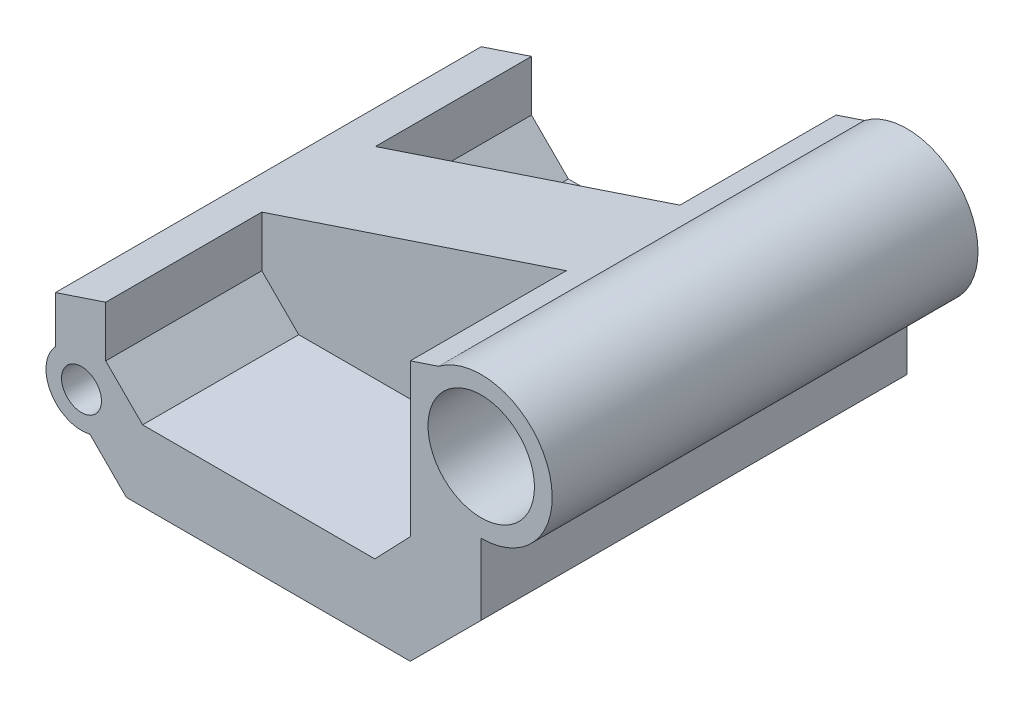
ISO-10303-21;
HEADER;
FILE_DESCRIPTION(('STEP AP214'),'2;1');
FILE_NAME('part.step','',(''),(''),'','','');
FILE_SCHEMA(('AUTOMOTIVE_DESIGN { 1 0 10303 214 1 1 1 1 }'));
ENDSEC;
DATA;
#1=APPLICATION_CONTEXT('core data for automotive mechanical design processes');
#2=APPLICATION_PROTOCOL_DEFINITION('international standard','automotive_design',2000,#1);
#3=PRODUCT_CONTEXT('',#1,'mechanical');
#4=PRODUCT('Part','Part','',(#3));
#5=PRODUCT_RELATED_PRODUCT_CATEGORY('part','',(#4));
#6=PRODUCT_DEFINITION_FORMATION('','',#4);
#7=PRODUCT_DEFINITION_CONTEXT('part definition',#1,'design');
#8=PRODUCT_DEFINITION('design','',#6,#7);
#9=PRODUCT_DEFINITION_SHAPE('','',#8);
#10=(LENGTH_UNIT() NAMED_UNIT(*) SI_UNIT(.MILLI.,.METRE.));
#11=(NAMED_UNIT(*) PLANE_ANGLE_UNIT() SI_UNIT($,.RADIAN.));
#12=(NAMED_UNIT(*) SI_UNIT($,.STERADIAN.) SOLID_ANGLE_UNIT());
#13=UNCERTAINTY_MEASURE_WITH_UNIT(LENGTH_MEASURE(1.E-05),#10,'distance_accuracy_value','');
#14=(GEOMETRIC_REPRESENTATION_CONTEXT(3) GLOBAL_UNCERTAINTY_ASSIGNED_CONTEXT((#13)) GLOBAL_UNIT_ASSIGNED_CONTEXT((#10,
#11,#12)) REPRESENTATION_CONTEXT('',''));
#15=CARTESIAN_POINT('',(0.,0.,0.));
#16=DIRECTION('',(0.,0.,1.));
#17=DIRECTION('',(1.,0.,0.));
#18=AXIS2_PLACEMENT_3D('',#15,#16,#17);
#19=CARTESIAN_POINT('',(25.4,1.40461226177703,-19.05));
#20=DIRECTION('',(1.,0.,0.));
#21=DIRECTION('',(0.,0.,-1.));
#22=AXIS2_PLACEMENT_3D('',#19,#20,#21);
#23=PLANE('',#22);
#24=DIRECTION('',(0.,0.,-1.));
#25=VECTOR('',#24,1.);
#26=CARTESIAN_POINT('',(25.4,10.0924921525294,12.7));
#27=LINE('',#26,#25);
#28=CARTESIAN_POINT('',(25.4,10.0924921525294,-1.27));
#29=VERTEX_POINT('',#28);
#30=CARTESIAN_POINT('',(25.4,10.0924921525294,-12.7));
#31=VERTEX_POINT('',#30);
#32=EDGE_CURVE('E239',#29,#31,#27,.T.);
#33=ORIENTED_EDGE('',*,*,#32,.F.);
#34=DIRECTION('',(0.,-1.,0.));
#35=VECTOR('',#34,1.);
#36=CARTESIAN_POINT('',(25.4,14.104612261777,-1.27));
#37=LINE('',#36,#35);
#38=CARTESIAN_POINT('',(25.4,14.104612261777,-1.27));
#39=VERTEX_POINT('',#38);
#40=EDGE_CURVE('E223',#39,#29,#37,.T.);
#41=ORIENTED_EDGE('',*,*,#40,.F.);
#42=DIRECTION('',(0.,0.,1.));
#43=VECTOR('',#42,1.);
#44=CARTESIAN_POINT('',(25.4,14.104612261777,-19.05));
#45=LINE('',#44,#43);
#46=CARTESIAN_POINT('',(25.4,14.104612261777,-19.05));
#47=VERTEX_POINT('',#46);
#48=EDGE_CURVE('E414',#47,#39,#45,.T.);
#49=ORIENTED_EDGE('',*,*,#48,.F.);
#50=DIRECTION('',(0.,1.,0.));
#51=VECTOR('',#50,1.);
#52=CARTESIAN_POINT('',(25.4,1.40461226177703,-19.05));
#53=LINE('',#52,#51);
#54=CARTESIAN_POINT('',(25.4,9.90939841905211,-19.05));
#55=VERTEX_POINT('',#54);
#56=EDGE_CURVE('E402',#55,#47,#53,.T.);
#57=ORIENTED_EDGE('',*,*,#56,.F.);
#58=DIRECTION('',(0.,0.,1.));
#59=VECTOR('',#58,1.);
#60=CARTESIAN_POINT('',(25.4,9.90939841905211,-25.6706541667691));
#61=LINE('',#60,#59);
#62=CARTESIAN_POINT('',(25.4,9.90939841905211,-12.7));
#63=VERTEX_POINT('',#62);
#64=EDGE_CURVE('E269',#55,#63,#61,.T.);
#65=ORIENTED_EDGE('',*,*,#64,.T.);
#66=DIRECTION('',(0.,-1.,0.));
#67=VECTOR('',#66,1.);
#68=CARTESIAN_POINT('',(25.4,1.40461226177703,-12.7));
#69=LINE('',#68,#67);
#70=EDGE_CURVE('E61',#31,#63,#69,.T.);
#71=ORIENTED_EDGE('',*,*,#70,.F.);
#72=EDGE_LOOP('',(#33,#41,#49,#57,#65,#71));
#73=FACE_BOUND('',#72,.T.);
#74=ADVANCED_FACE('F39',(#73),#23,.F.);
#75=CARTESIAN_POINT('',(27.7318493983136,7.75461226177703,-25.6706541667691));
#76=DIRECTION('',(0.,0.,1.));
#77=DIRECTION('',(1.,0.,0.));
#78=AXIS2_PLACEMENT_3D('',#75,#76,#77);
#79=CYLINDRICAL_SURFACE('',#78,3.175);
#80=DIRECTION('',(0.,0.,1.));
#81=VECTOR('',#80,1.);
#82=CARTESIAN_POINT('',(28.4845002373873,4.67011202438982,-25.6706541667691));
#83=LINE('',#82,#81);
#84=CARTESIAN_POINT('',(28.4845002373873,4.67011202438982,-19.05));
#85=VERTEX_POINT('',#84);
#86=CARTESIAN_POINT('',(28.4845002373873,4.67011202438982,-12.7));
#87=VERTEX_POINT('',#86);
#88=EDGE_CURVE('E265',#85,#87,#83,.T.);
#89=ORIENTED_EDGE('',*,*,#88,.T.);
#90=CARTESIAN_POINT('',(27.7318493983136,7.75461226177703,-12.7));
#91=DIRECTION('',(0.,0.,1.));
#92=DIRECTION('',(1.,0.,0.));
#93=AXIS2_PLACEMENT_3D('',#90,#91,#92);
#94=CIRCLE('',#93,3.175);
#95=EDGE_CURVE('E423',#87,#63,#94,.F.);
#96=ORIENTED_EDGE('',*,*,#95,.T.);
#97=ORIENTED_EDGE('',*,*,#64,.F.);
#98=CARTESIAN_POINT('',(27.7318493983136,7.75461226177703,-19.05));
#99=DIRECTION('',(0.,0.,-1.));
#100=DIRECTION('',(-1.,0.,0.));
#101=AXIS2_PLACEMENT_3D('',#98,#99,#100);
#102=CIRCLE('',#101,3.175);
#103=EDGE_CURVE('E261',#55,#85,#102,.F.);
#104=ORIENTED_EDGE('',*,*,#103,.T.);
#105=EDGE_LOOP('',(#89,#96,#97,#104));
#106=FACE_BOUND('',#105,.T.);
#107=ADVANCED_FACE('F504',(#106),#79,.T.);
#108=CARTESIAN_POINT('',(27.7318493983136,7.75461226177703,19.05));
#109=DIRECTION('',(0.,0.,1.));
#110=DIRECTION('',(1.,0.,0.));
#111=AXIS2_PLACEMENT_3D('',#108,#109,#110);
#112=CYLINDRICAL_SURFACE('',#111,1.78600099999999);
#113=CARTESIAN_POINT('',(27.7318493983136,7.75461226177703,-19.05));
#114=DIRECTION('',(0.,0.,1.));
#115=DIRECTION('',(1.,0.,0.));
#116=AXIS2_PLACEMENT_3D('',#113,#114,#115);
#117=CIRCLE('',#116,1.78600099999999);
#118=CARTESIAN_POINT('',(29.5178503983136,7.75461226177703,-19.05));
#119=VERTEX_POINT('',#118);
#120=EDGE_CURVE('E255',#119,#119,#117,.T.);
#121=ORIENTED_EDGE('',*,*,#120,.F.);
#122=EDGE_LOOP('',(#121));
#123=FACE_BOUND('',#122,.T.);
#124=CARTESIAN_POINT('',(27.7318493983136,7.75461226177703,-12.7));
#125=DIRECTION('',(0.,0.,1.));
#126=DIRECTION('',(1.,0.,0.));
#127=AXIS2_PLACEMENT_3D('',#124,#125,#126);
#128=CIRCLE('',#127,1.78600099999999);
#129=CARTESIAN_POINT('',(29.5178503983136,7.75461226177703,-12.7));
#130=VERTEX_POINT('',#129);
#131=EDGE_CURVE('E420',#130,#130,#128,.F.);
#132=ORIENTED_EDGE('',*,*,#131,.F.);
#133=EDGE_LOOP('',(#132));
#134=FACE_BOUND('',#133,.T.);
#135=ADVANCED_FACE('F508',(#123,#134),#112,.F.);
#136=CARTESIAN_POINT('',(0.,0.,-19.05));
#137=DIRECTION('',(0.,0.,-1.));
#138=DIRECTION('',(-1.,0.,0.));
#139=AXIS2_PLACEMENT_3D('',#136,#137,#138);
#140=PLANE('',#139);
#141=ORIENTED_EDGE('',*,*,#120,.T.);
#142=EDGE_LOOP('',(#141));
#143=FACE_BOUND('',#142,.T.);
#144=ORIENTED_EDGE('',*,*,#103,.F.);
#145=ORIENTED_EDGE('',*,*,#56,.T.);
#146=DIRECTION('',(0.948683298050514,0.316227766016838,0.));
#147=VECTOR('',#146,1.);
#148=CARTESIAN_POINT('',(25.4,14.104612261777,-19.05));
#149=LINE('',#148,#147);
#150=CARTESIAN_POINT('',(29.899727950621,15.6045215786507,-19.05));
#151=VERTEX_POINT('',#150);
#152=EDGE_CURVE('E405',#47,#151,#149,.T.);
#153=ORIENTED_EDGE('',*,*,#152,.T.);
#154=DIRECTION('',(0.,1.,0.));
#155=VECTOR('',#154,1.);
#156=CARTESIAN_POINT('',(29.899727950621,7.75461226177703,-19.05));
#157=LINE('',#156,#155);
#158=CARTESIAN_POINT('',(29.899727950621,11.056612261777,-19.05));
#159=VERTEX_POINT('',#158);
#160=EDGE_CURVE('E300',#159,#151,#157,.T.);
#161=ORIENTED_EDGE('',*,*,#160,.F.);
#162=DIRECTION('',(-0.707106781186548,0.707106781186548,0.));
#163=VECTOR('',#162,1.);
#164=CARTESIAN_POINT('',(33.201727950621,7.75461226177703,-19.05));
#165=LINE('',#164,#163);
#166=CARTESIAN_POINT('',(33.201727950621,7.75461226177703,-19.05));
#167=VERTEX_POINT('',#166);
#168=EDGE_CURVE('E274',#167,#159,#165,.T.);
#169=ORIENTED_EDGE('',*,*,#168,.F.);
#170=DIRECTION('',(-1.,0.,0.));
#171=VECTOR('',#170,1.);
#172=CARTESIAN_POINT('',(53.975,7.75461226177703,-19.05));
#173=LINE('',#172,#171);
#174=CARTESIAN_POINT('',(53.975,7.75461226177703,-19.05));
#175=VERTEX_POINT('',#174);
#176=EDGE_CURVE('E316',#175,#167,#173,.T.);
#177=ORIENTED_EDGE('',*,*,#176,.F.);
#178=DIRECTION('',(-0.693108716251784,-0.720833064901856,0.));
#179=VECTOR('',#178,1.);
#180=CARTESIAN_POINT('',(57.15,11.056612261777,-19.05));
#181=LINE('',#180,#179);
#182=CARTESIAN_POINT('',(57.15,11.056612261777,-19.05));
#183=VERTEX_POINT('',#182);
#184=EDGE_CURVE('E313',#183,#175,#181,.T.);
#185=ORIENTED_EDGE('',*,*,#184,.F.);
#186=DIRECTION('',(0.,-1.,0.));
#187=VECTOR('',#186,1.);
#188=CARTESIAN_POINT('',(57.15,24.6879455951104,-19.05));
#189=LINE('',#188,#187);
#190=CARTESIAN_POINT('',(57.15,24.6879455951104,-19.05));
#191=VERTEX_POINT('',#190);
#192=EDGE_CURVE('E295',#191,#183,#189,.T.);
#193=ORIENTED_EDGE('',*,*,#192,.F.);
#194=CARTESIAN_POINT('',(59.69,25.534612261777,-19.05));
#195=VERTEX_POINT('',#194);
#196=EDGE_CURVE('E404',#191,#195,#149,.T.);
#197=ORIENTED_EDGE('',*,*,#196,.T.);
#198=CARTESIAN_POINT('',(63.5,20.454612261777,-19.05));
#199=DIRECTION('',(0.,0.,-1.));
#200=DIRECTION('',(-1.,0.,0.));
#201=AXIS2_PLACEMENT_3D('',#198,#199,#200);
#202=CIRCLE('',#201,6.35);
#203=CARTESIAN_POINT('',(63.5,14.104612261777,-19.05));
#204=VERTEX_POINT('',#203);
#205=EDGE_CURVE('E381',#204,#195,#202,.F.);
#206=ORIENTED_EDGE('',*,*,#205,.F.);
#207=DIRECTION('',(0.,-1.,0.));
#208=VECTOR('',#207,1.);
#209=CARTESIAN_POINT('',(63.5,26.804612261777,-19.05));
#210=LINE('',#209,#208);
#211=CARTESIAN_POINT('',(63.5,7.75461226177704,-19.05));
#212=VERTEX_POINT('',#211);
#213=EDGE_CURVE('E408',#204,#212,#210,.T.);
#214=ORIENTED_EDGE('',*,*,#213,.T.);
#215=DIRECTION('',(-0.707106781186547,-0.707106781186548,0.));
#216=VECTOR('',#215,1.);
#217=CARTESIAN_POINT('',(63.5,7.75461226177704,-19.05));
#218=LINE('',#217,#216);
#219=CARTESIAN_POINT('',(57.15,1.40461226177703,-19.05));
#220=VERTEX_POINT('',#219);
#221=EDGE_CURVE('E364',#212,#220,#218,.T.);
#222=ORIENTED_EDGE('',*,*,#221,.T.);
#223=DIRECTION('',(1.,0.,0.));
#224=VECTOR('',#223,1.);
#225=CARTESIAN_POINT('',(25.4,1.40461226177703,-19.05));
#226=LINE('',#225,#224);
#227=CARTESIAN_POINT('',(31.7500000000001,1.40461226177703,-19.05));
#228=VERTEX_POINT('',#227);
#229=EDGE_CURVE('E411',#228,#220,#226,.T.);
#230=ORIENTED_EDGE('',*,*,#229,.F.);
#231=DIRECTION('',(0.707106781186556,-0.707106781186539,0.));
#232=VECTOR('',#231,1.);
#233=CARTESIAN_POINT('',(25.4,7.75461226177703,-19.05));
#234=LINE('',#233,#232);
#235=EDGE_CURVE('E289',#85,#228,#234,.T.);
#236=ORIENTED_EDGE('',*,*,#235,.F.);
#237=EDGE_LOOP('',(#144,#145,#153,#161,#169,#177,#185,#193,#197,#206,#214,#222,#230,#236));
#238=FACE_BOUND('',#237,.T.);
#239=CARTESIAN_POINT('',(63.5,20.454612261777,-19.05));
#240=DIRECTION('',(0.,0.,1.));
#241=DIRECTION('',(1.,0.,0.));
#242=AXIS2_PLACEMENT_3D('',#239,#240,#241);
#243=CIRCLE('',#242,4.76249999999999);
#244=CARTESIAN_POINT('',(68.2625,20.454612261777,-19.05));
#245=VERTEX_POINT('',#244);
#246=EDGE_CURVE('E375',#245,#245,#243,.T.);
#247=ORIENTED_EDGE('',*,*,#246,.T.);
#248=EDGE_LOOP('',(#247));
#249=FACE_BOUND('',#248,.T.);
#250=ADVANCED_FACE('F513',(#143,#238,#249),#140,.T.);
#251=CARTESIAN_POINT('',(25.4,14.104612261777,1.27));
#252=VERTEX_POINT('',#251);
#253=CARTESIAN_POINT('',(25.4,14.104612261777,19.05));
#254=VERTEX_POINT('',#253);
#255=EDGE_CURVE('E413',#252,#254,#45,.T.);
#256=ORIENTED_EDGE('',*,*,#255,.F.);
#257=DIRECTION('',(0.,1.,0.));
#258=VECTOR('',#257,1.);
#259=CARTESIAN_POINT('',(25.4,14.104612261777,1.27));
#260=LINE('',#259,#258);
#261=CARTESIAN_POINT('',(25.4,10.0924921525294,1.27));
#262=VERTEX_POINT('',#261);
#263=EDGE_CURVE('E234',#262,#252,#260,.T.);
#264=ORIENTED_EDGE('',*,*,#263,.F.);
#265=CARTESIAN_POINT('',(25.4,10.0924921525294,12.7));
#266=VERTEX_POINT('',#265);
#267=EDGE_CURVE('E243',#266,#262,#27,.T.);
#268=ORIENTED_EDGE('',*,*,#267,.F.);
#269=DIRECTION('',(0.,-1.,0.));
#270=VECTOR('',#269,1.);
#271=CARTESIAN_POINT('',(25.4,1.40461226177703,12.7));
#272=LINE('',#271,#270);
#273=CARTESIAN_POINT('',(25.4,9.90939841905211,12.7));
#274=VERTEX_POINT('',#273);
#275=EDGE_CURVE('E244',#266,#274,#272,.T.);
#276=ORIENTED_EDGE('',*,*,#275,.T.);
#277=CARTESIAN_POINT('',(25.4,9.90939841905211,19.05));
#278=VERTEX_POINT('',#277);
#279=EDGE_CURVE('E268',#274,#278,#61,.T.);
#280=ORIENTED_EDGE('',*,*,#279,.T.);
#281=DIRECTION('',(0.,1.,0.));
#282=VECTOR('',#281,1.);
#283=CARTESIAN_POINT('',(25.4,1.40461226177703,19.05));
#284=LINE('',#283,#282);
#285=EDGE_CURVE('E390',#278,#254,#284,.T.);
#286=ORIENTED_EDGE('',*,*,#285,.T.);
#287=EDGE_LOOP('',(#256,#264,#268,#276,#280,#286));
#288=FACE_BOUND('',#287,.T.);
#289=ADVANCED_FACE('F41',(#288),#23,.F.);
#290=CARTESIAN_POINT('',(25.4,1.40461226177703,-19.05));
#291=DIRECTION('',(0.,-1.,0.));
#292=DIRECTION('',(0.,0.,-1.));
#293=AXIS2_PLACEMENT_3D('',#290,#291,#292);
#294=PLANE('',#293);
#295=DIRECTION('',(1.,0.,0.));
#296=VECTOR('',#295,1.);
#297=CARTESIAN_POINT('',(25.4,1.40461226177703,19.05));
#298=LINE('',#297,#296);
#299=CARTESIAN_POINT('',(31.7500000000001,1.40461226177703,19.05));
#300=VERTEX_POINT('',#299);
#301=CARTESIAN_POINT('',(57.15,1.40461226177703,19.05));
#302=VERTEX_POINT('',#301);
#303=EDGE_CURVE('E400',#300,#302,#298,.T.);
#304=ORIENTED_EDGE('',*,*,#303,.F.);
#305=DIRECTION('',(0.,0.,1.));
#306=VECTOR('',#305,1.);
#307=CARTESIAN_POINT('',(31.7500000000001,1.40461226177703,-19.05));
#308=LINE('',#307,#306);
#309=EDGE_CURVE('E291',#228,#300,#308,.T.);
#310=ORIENTED_EDGE('',*,*,#309,.F.);
#311=ORIENTED_EDGE('',*,*,#229,.T.);
#312=DIRECTION('',(0.,0.,1.));
#313=VECTOR('',#312,1.);
#314=CARTESIAN_POINT('',(57.15,1.40461226177703,-28.0302561210692));
#315=LINE('',#314,#313);
#316=EDGE_CURVE('E367',#220,#302,#315,.T.);
#317=ORIENTED_EDGE('',*,*,#316,.T.);
#318=EDGE_LOOP('',(#304,#310,#311,#317));
#319=FACE_BOUND('',#318,.T.);
#320=ADVANCED_FACE('F512',(#319),#294,.T.);
#321=CARTESIAN_POINT('',(0.,0.,19.05));
#322=DIRECTION('',(0.,0.,-1.));
#323=DIRECTION('',(-1.,0.,0.));
#324=AXIS2_PLACEMENT_3D('',#321,#322,#323);
#325=PLANE('',#324);
#326=CARTESIAN_POINT('',(27.7318493983136,7.75461226177703,19.05));
#327=DIRECTION('',(0.,0.,1.));
#328=DIRECTION('',(1.,0.,0.));
#329=AXIS2_PLACEMENT_3D('',#326,#327,#328);
#330=CIRCLE('',#329,1.78600099999999);
#331=CARTESIAN_POINT('',(29.5178503983136,7.75461226177703,19.05));
#332=VERTEX_POINT('',#331);
#333=EDGE_CURVE('E247',#332,#332,#330,.T.);
#334=ORIENTED_EDGE('',*,*,#333,.F.);
#335=EDGE_LOOP('',(#334));
#336=FACE_BOUND('',#335,.T.);
#337=ORIENTED_EDGE('',*,*,#285,.F.);
#338=CARTESIAN_POINT('',(27.7318493983136,7.75461226177703,19.05));
#339=DIRECTION('',(0.,0.,1.));
#340=DIRECTION('',(1.,0.,0.));
#341=AXIS2_PLACEMENT_3D('',#338,#339,#340);
#342=CIRCLE('',#341,3.175);
#343=CARTESIAN_POINT('',(28.4845002373873,4.67011202438982,19.05));
#344=VERTEX_POINT('',#343);
#345=EDGE_CURVE('E258',#278,#344,#342,.T.);
#346=ORIENTED_EDGE('',*,*,#345,.T.);
#347=DIRECTION('',(0.707106781186556,-0.707106781186539,0.));
#348=VECTOR('',#347,1.);
#349=CARTESIAN_POINT('',(25.4,7.75461226177703,19.05));
#350=LINE('',#349,#348);
#351=EDGE_CURVE('E288',#344,#300,#350,.T.);
#352=ORIENTED_EDGE('',*,*,#351,.T.);
#353=ORIENTED_EDGE('',*,*,#303,.T.);
#354=DIRECTION('',(-0.707106781186547,-0.707106781186548,0.));
#355=VECTOR('',#354,1.);
#356=CARTESIAN_POINT('',(63.5,7.75461226177704,19.05));
#357=LINE('',#356,#355);
#358=CARTESIAN_POINT('',(63.5,7.75461226177704,19.05));
#359=VERTEX_POINT('',#358);
#360=EDGE_CURVE('E354',#359,#302,#357,.T.);
#361=ORIENTED_EDGE('',*,*,#360,.F.);
#362=DIRECTION('',(0.,-1.,0.));
#363=VECTOR('',#362,1.);
#364=CARTESIAN_POINT('',(63.5,26.804612261777,19.05));
#365=LINE('',#364,#363);
#366=CARTESIAN_POINT('',(63.5,14.104612261777,19.05));
#367=VERTEX_POINT('',#366);
#368=EDGE_CURVE('E397',#367,#359,#365,.T.);
#369=ORIENTED_EDGE('',*,*,#368,.F.);
#370=CARTESIAN_POINT('',(63.5,20.454612261777,19.05));
#371=DIRECTION('',(0.,0.,1.));
#372=DIRECTION('',(1.,0.,0.));
#373=AXIS2_PLACEMENT_3D('',#370,#371,#372);
#374=CIRCLE('',#373,6.35);
#375=CARTESIAN_POINT('',(59.69,25.534612261777,19.05));
#376=VERTEX_POINT('',#375);
#377=EDGE_CURVE('E378',#367,#376,#374,.T.);
#378=ORIENTED_EDGE('',*,*,#377,.T.);
#379=DIRECTION('',(0.948683298050514,0.316227766016838,0.));
#380=VECTOR('',#379,1.);
#381=CARTESIAN_POINT('',(25.4,14.104612261777,19.05));
#382=LINE('',#381,#380);
#383=CARTESIAN_POINT('',(57.15,24.6879455951104,19.05));
#384=VERTEX_POINT('',#383);
#385=EDGE_CURVE('E393',#384,#376,#382,.T.);
#386=ORIENTED_EDGE('',*,*,#385,.F.);
#387=DIRECTION('',(0.,1.,0.));
#388=VECTOR('',#387,1.);
#389=CARTESIAN_POINT('',(57.15,11.056612261777,19.05));
#390=LINE('',#389,#388);
#391=CARTESIAN_POINT('',(57.15,11.056612261777,19.05));
#392=VERTEX_POINT('',#391);
#393=EDGE_CURVE('E322',#392,#384,#390,.T.);
#394=ORIENTED_EDGE('',*,*,#393,.F.);
#395=DIRECTION('',(0.693108716251784,0.720833064901856,0.));
#396=VECTOR('',#395,1.);
#397=CARTESIAN_POINT('',(53.975,7.75461226177703,19.05));
#398=LINE('',#397,#396);
#399=CARTESIAN_POINT('',(53.975,7.75461226177703,19.05));
#400=VERTEX_POINT('',#399);
#401=EDGE_CURVE('E332',#400,#392,#398,.T.);
#402=ORIENTED_EDGE('',*,*,#401,.F.);
#403=DIRECTION('',(1.,0.,0.));
#404=VECTOR('',#403,1.);
#405=CARTESIAN_POINT('',(29.899727950621,7.75461226177703,19.05));
#406=LINE('',#405,#404);
#407=CARTESIAN_POINT('',(33.201727950621,7.75461226177703,19.05));
#408=VERTEX_POINT('',#407);
#409=EDGE_CURVE('E348',#408,#400,#406,.T.);
#410=ORIENTED_EDGE('',*,*,#409,.F.);
#411=DIRECTION('',(-0.707106781186547,0.707106781186547,0.));
#412=VECTOR('',#411,1.);
#413=CARTESIAN_POINT('',(33.201727950621,7.75461226177703,19.05));
#414=LINE('',#413,#412);
#415=CARTESIAN_POINT('',(29.899727950621,11.056612261777,19.05));
#416=VERTEX_POINT('',#415);
#417=EDGE_CURVE('E271',#408,#416,#414,.T.);
#418=ORIENTED_EDGE('',*,*,#417,.T.);
#419=DIRECTION('',(0.,-1.,0.));
#420=VECTOR('',#419,1.);
#421=CARTESIAN_POINT('',(29.899727950621,15.6045215786507,19.05));
#422=LINE('',#421,#420);
#423=CARTESIAN_POINT('',(29.899727950621,15.6045215786507,19.05));
#424=VERTEX_POINT('',#423);
#425=EDGE_CURVE('E345',#424,#416,#422,.T.);
#426=ORIENTED_EDGE('',*,*,#425,.F.);
#427=EDGE_CURVE('E394',#254,#424,#382,.T.);
#428=ORIENTED_EDGE('',*,*,#427,.F.);
#429=EDGE_LOOP('',(#337,#346,#352,#353,#361,#369,#378,#386,#394,#402,#410,#418,#426,#428));
#430=FACE_BOUND('',#429,.T.);
#431=CARTESIAN_POINT('',(63.5,20.454612261777,19.05));
#432=DIRECTION('',(0.,0.,1.));
#433=DIRECTION('',(1.,0.,0.));
#434=AXIS2_PLACEMENT_3D('',#431,#432,#433);
#435=CIRCLE('',#434,4.7625);
#436=CARTESIAN_POINT('',(68.2625,20.454612261777,19.05));
#437=VERTEX_POINT('',#436);
#438=EDGE_CURVE('E372',#437,#437,#435,.T.);
#439=ORIENTED_EDGE('',*,*,#438,.F.);
#440=EDGE_LOOP('',(#439));
#441=FACE_BOUND('',#440,.T.);
#442=ADVANCED_FACE('F473',(#336,#430,#441),#325,.F.);
#443=CARTESIAN_POINT('',(25.4,14.104612261777,-19.05));
#444=DIRECTION('',(0.316227766016838,-0.948683298050514,0.));
#445=DIRECTION('',(0.948683298050514,0.316227766016838,0.));
#446=AXIS2_PLACEMENT_3D('',#443,#444,#445);
#447=PLANE('',#446);
#448=DIRECTION('',(0.948683298050514,0.316227766016838,0.));
#449=VECTOR('',#448,1.);
#450=CARTESIAN_POINT('',(29.899727950621,15.6045215786507,-5.08));
#451=LINE('',#450,#449);
#452=CARTESIAN_POINT('',(29.899727950621,15.6045215786507,-5.08));
#453=VERTEX_POINT('',#452);
#454=CARTESIAN_POINT('',(57.15,24.6879455951104,-5.08));
#455=VERTEX_POINT('',#454);
#456=EDGE_CURVE('E296',#453,#455,#451,.T.);
#457=ORIENTED_EDGE('',*,*,#456,.F.);
#458=DIRECTION('',(0.,0.,-1.));
#459=VECTOR('',#458,1.);
#460=CARTESIAN_POINT('',(29.899727950621,15.6045215786507,-5.08));
#461=LINE('',#460,#459);
#462=EDGE_CURVE('E319',#453,#151,#461,.T.);
#463=ORIENTED_EDGE('',*,*,#462,.T.);
#464=ORIENTED_EDGE('',*,*,#152,.F.);
#465=ORIENTED_EDGE('',*,*,#48,.T.);
#466=DIRECTION('',(0.,0.,-1.));
#467=VECTOR('',#466,1.);
#468=CARTESIAN_POINT('',(25.4,14.104612261777,-1.27));
#469=LINE('',#468,#467);
#470=EDGE_CURVE('E443',#252,#39,#469,.T.);
#471=ORIENTED_EDGE('',*,*,#470,.F.);
#472=ORIENTED_EDGE('',*,*,#255,.T.);
#473=ORIENTED_EDGE('',*,*,#427,.T.);
#474=DIRECTION('',(0.,0.,1.));
#475=VECTOR('',#474,1.);
#476=CARTESIAN_POINT('',(29.899727950621,15.6045215786507,5.08));
#477=LINE('',#476,#475);
#478=CARTESIAN_POINT('',(29.899727950621,15.6045215786507,5.08));
#479=VERTEX_POINT('',#478);
#480=EDGE_CURVE('E358',#479,#424,#477,.T.);
#481=ORIENTED_EDGE('',*,*,#480,.F.);
#482=DIRECTION('',(-0.948683298050514,-0.316227766016838,0.));
#483=VECTOR('',#482,1.);
#484=CARTESIAN_POINT('',(57.15,24.6879455951104,5.08));
#485=LINE('',#484,#483);
#486=CARTESIAN_POINT('',(57.15,24.6879455951104,5.08));
#487=VERTEX_POINT('',#486);
#488=EDGE_CURVE('E331',#487,#479,#485,.T.);
#489=ORIENTED_EDGE('',*,*,#488,.F.);
#490=DIRECTION('',(0.,0.,1.));
#491=VECTOR('',#490,1.);
#492=CARTESIAN_POINT('',(57.15,24.6879455951104,5.08));
#493=LINE('',#492,#491);
#494=EDGE_CURVE('E343',#487,#384,#493,.T.);
#495=ORIENTED_EDGE('',*,*,#494,.T.);
#496=ORIENTED_EDGE('',*,*,#385,.T.);
#497=DIRECTION('',(0.,0.,1.));
#498=VECTOR('',#497,1.);
#499=CARTESIAN_POINT('',(59.69,25.534612261777,-37.0105122421383));
#500=LINE('',#499,#498);
#501=EDGE_CURVE('E387',#376,#195,#500,.F.);
#502=ORIENTED_EDGE('',*,*,#501,.T.);
#503=ORIENTED_EDGE('',*,*,#196,.F.);
#504=DIRECTION('',(0.,0.,-1.));
#505=VECTOR('',#504,1.);
#506=CARTESIAN_POINT('',(57.15,24.6879455951104,-5.08));
#507=LINE('',#506,#505);
#508=EDGE_CURVE('E310',#455,#191,#507,.T.);
#509=ORIENTED_EDGE('',*,*,#508,.F.);
#510=EDGE_LOOP('',(#457,#463,#464,#465,#471,#472,#473,#481,#489,#495,#496,#502,#503,#509));
#511=FACE_BOUND('',#510,.T.);
#512=ADVANCED_FACE('F480',(#511),#447,.F.);
#513=CARTESIAN_POINT('',(63.5,26.804612261777,-19.05));
#514=DIRECTION('',(-1.,0.,0.));
#515=DIRECTION('',(0.,0.,1.));
#516=AXIS2_PLACEMENT_3D('',#513,#514,#515);
#517=PLANE('',#516);
#518=ORIENTED_EDGE('',*,*,#368,.T.);
#519=DIRECTION('',(0.,0.,1.));
#520=VECTOR('',#519,1.);
#521=CARTESIAN_POINT('',(63.5,7.75461226177704,-28.0302561210692));
#522=LINE('',#521,#520);
#523=EDGE_CURVE('E370',#212,#359,#522,.T.);
#524=ORIENTED_EDGE('',*,*,#523,.F.);
#525=ORIENTED_EDGE('',*,*,#213,.F.);
#526=DIRECTION('',(0.,0.,1.));
#527=VECTOR('',#526,1.);
#528=CARTESIAN_POINT('',(63.5,14.104612261777,-37.0105122421383));
#529=LINE('',#528,#527);
#530=EDGE_CURVE('E384',#204,#367,#529,.T.);
#531=ORIENTED_EDGE('',*,*,#530,.T.);
#532=EDGE_LOOP('',(#518,#524,#525,#531));
#533=FACE_BOUND('',#532,.T.);
#534=ADVANCED_FACE('F532',(#533),#517,.F.);
#535=CARTESIAN_POINT('',(63.5,20.454612261777,-37.0105122421383));
#536=DIRECTION('',(0.,0.,1.));
#537=DIRECTION('',(1.,0.,0.));
#538=AXIS2_PLACEMENT_3D('',#535,#536,#537);
#539=CYLINDRICAL_SURFACE('',#538,6.35);
#540=ORIENTED_EDGE('',*,*,#501,.F.);
#541=ORIENTED_EDGE('',*,*,#377,.F.);
#542=ORIENTED_EDGE('',*,*,#530,.F.);
#543=ORIENTED_EDGE('',*,*,#205,.T.);
#544=EDGE_LOOP('',(#540,#541,#542,#543));
#545=FACE_BOUND('',#544,.T.);
#546=ADVANCED_FACE('F534',(#545),#539,.T.);
#547=CARTESIAN_POINT('',(63.5,20.454612261777,19.05));
#548=DIRECTION('',(0.,0.,1.));
#549=DIRECTION('',(1.,0.,0.));
#550=AXIS2_PLACEMENT_3D('',#547,#548,#549);
#551=CYLINDRICAL_SURFACE('',#550,4.7625);
#552=ORIENTED_EDGE('',*,*,#246,.F.);
#553=EDGE_LOOP('',(#552));
#554=FACE_BOUND('',#553,.T.);
#555=ORIENTED_EDGE('',*,*,#438,.T.);
#556=EDGE_LOOP('',(#555));
#557=FACE_BOUND('',#556,.T.);
#558=ADVANCED_FACE('F604',(#554,#557),#551,.F.);
#559=CARTESIAN_POINT('',(63.5,7.75461226177704,-28.0302561210692));
#560=DIRECTION('',(-0.707106781186548,0.707106781186547,0.));
#561=DIRECTION('',(-0.707106781186547,-0.707106781186548,0.));
#562=AXIS2_PLACEMENT_3D('',#559,#560,#561);
#563=PLANE('',#562);
#564=ORIENTED_EDGE('',*,*,#523,.T.);
#565=ORIENTED_EDGE('',*,*,#360,.T.);
#566=ORIENTED_EDGE('',*,*,#316,.F.);
#567=ORIENTED_EDGE('',*,*,#221,.F.);
#568=EDGE_LOOP('',(#564,#565,#566,#567));
#569=FACE_BOUND('',#568,.T.);
#570=ADVANCED_FACE('F600',(#569),#563,.F.);
#571=CARTESIAN_POINT('',(57.15,11.056612261777,5.08));
#572=DIRECTION('',(1.,0.,0.));
#573=DIRECTION('',(0.,1.,0.));
#574=AXIS2_PLACEMENT_3D('',#571,#572,#573);
#575=PLANE('',#574);
#576=ORIENTED_EDGE('',*,*,#393,.T.);
#577=ORIENTED_EDGE('',*,*,#494,.F.);
#578=DIRECTION('',(0.,1.,0.));
#579=VECTOR('',#578,1.);
#580=CARTESIAN_POINT('',(57.15,11.056612261777,5.08));
#581=LINE('',#580,#579);
#582=CARTESIAN_POINT('',(57.15,11.056612261777,5.08));
#583=VERTEX_POINT('',#582);
#584=EDGE_CURVE('E328',#583,#487,#581,.T.);
#585=ORIENTED_EDGE('',*,*,#584,.F.);
#586=DIRECTION('',(0.,0.,1.));
#587=VECTOR('',#586,1.);
#588=CARTESIAN_POINT('',(57.15,11.056612261777,5.08));
#589=LINE('',#588,#587);
#590=EDGE_CURVE('E352',#583,#392,#589,.T.);
#591=ORIENTED_EDGE('',*,*,#590,.T.);
#592=EDGE_LOOP('',(#576,#577,#585,#591));
#593=FACE_BOUND('',#592,.T.);
#594=ADVANCED_FACE('F590',(#593),#575,.F.);
#595=CARTESIAN_POINT('',(53.975,7.75461226177703,5.08));
#596=DIRECTION('',(0.720833064901856,-0.693108716251784,0.));
#597=DIRECTION('',(0.693108716251784,0.720833064901856,0.));
#598=AXIS2_PLACEMENT_3D('',#595,#596,#597);
#599=PLANE('',#598);
#600=ORIENTED_EDGE('',*,*,#401,.T.);
#601=ORIENTED_EDGE('',*,*,#590,.F.);
#602=DIRECTION('',(0.693108716251784,0.720833064901856,0.));
#603=VECTOR('',#602,1.);
#604=CARTESIAN_POINT('',(53.975,7.75461226177703,5.08));
#605=LINE('',#604,#603);
#606=CARTESIAN_POINT('',(53.975,7.75461226177703,5.08));
#607=VERTEX_POINT('',#606);
#608=EDGE_CURVE('E340',#607,#583,#605,.T.);
#609=ORIENTED_EDGE('',*,*,#608,.F.);
#610=DIRECTION('',(0.,0.,1.));
#611=VECTOR('',#610,1.);
#612=CARTESIAN_POINT('',(53.975,7.75461226177703,5.08));
#613=LINE('',#612,#611);
#614=EDGE_CURVE('E355',#607,#400,#613,.T.);
#615=ORIENTED_EDGE('',*,*,#614,.T.);
#616=EDGE_LOOP('',(#600,#601,#609,#615));
#617=FACE_BOUND('',#616,.T.);
#618=ADVANCED_FACE('F586',(#617),#599,.F.);
#619=CARTESIAN_POINT('',(29.899727950621,7.75461226177703,5.08));
#620=DIRECTION('',(0.,-1.,0.));
#621=DIRECTION('',(0.,0.,-1.));
#622=AXIS2_PLACEMENT_3D('',#619,#620,#621);
#623=PLANE('',#622);
#624=DIRECTION('',(1.,0.,0.));
#625=VECTOR('',#624,1.);
#626=CARTESIAN_POINT('',(29.899727950621,7.75461226177703,5.08));
#627=LINE('',#626,#625);
#628=CARTESIAN_POINT('',(33.201727950621,7.75461226177703,5.08));
#629=VERTEX_POINT('',#628);
#630=EDGE_CURVE('E338',#629,#607,#627,.T.);
#631=ORIENTED_EDGE('',*,*,#630,.F.);
#632=DIRECTION('',(0.,0.,1.));
#633=VECTOR('',#632,1.);
#634=CARTESIAN_POINT('',(33.201727950621,7.75461226177703,-23.719733182956));
#635=LINE('',#634,#633);
#636=EDGE_CURVE('E281',#629,#408,#635,.T.);
#637=ORIENTED_EDGE('',*,*,#636,.T.);
#638=ORIENTED_EDGE('',*,*,#409,.T.);
#639=ORIENTED_EDGE('',*,*,#614,.F.);
#640=EDGE_LOOP('',(#631,#637,#638,#639));
#641=FACE_BOUND('',#640,.T.);
#642=ADVANCED_FACE('F589',(#641),#623,.F.);
#643=CARTESIAN_POINT('',(29.899727950621,15.6045215786507,5.08));
#644=DIRECTION('',(-1.,0.,0.));
#645=DIRECTION('',(0.,0.,1.));
#646=AXIS2_PLACEMENT_3D('',#643,#644,#645);
#647=PLANE('',#646);
#648=ORIENTED_EDGE('',*,*,#425,.T.);
#649=DIRECTION('',(0.,0.,1.));
#650=VECTOR('',#649,1.);
#651=CARTESIAN_POINT('',(29.899727950621,11.056612261777,-23.719733182956));
#652=LINE('',#651,#650);
#653=CARTESIAN_POINT('',(29.899727950621,11.056612261777,5.08));
#654=VERTEX_POINT('',#653);
#655=EDGE_CURVE('E277',#654,#416,#652,.T.);
#656=ORIENTED_EDGE('',*,*,#655,.F.);
#657=DIRECTION('',(0.,-1.,0.));
#658=VECTOR('',#657,1.);
#659=CARTESIAN_POINT('',(29.899727950621,15.6045215786507,5.08));
#660=LINE('',#659,#658);
#661=EDGE_CURVE('E335',#479,#654,#660,.T.);
#662=ORIENTED_EDGE('',*,*,#661,.F.);
#663=ORIENTED_EDGE('',*,*,#480,.T.);
#664=EDGE_LOOP('',(#648,#656,#662,#663));
#665=FACE_BOUND('',#664,.T.);
#666=ADVANCED_FACE('F584',(#665),#647,.F.);
#667=CARTESIAN_POINT('',(0.,0.,5.08));
#668=DIRECTION('',(0.,0.,-1.));
#669=DIRECTION('',(-1.,0.,0.));
#670=AXIS2_PLACEMENT_3D('',#667,#668,#669);
#671=PLANE('',#670);
#672=ORIENTED_EDGE('',*,*,#661,.T.);
#673=DIRECTION('',(0.707106781186548,-0.707106781186548,0.));
#674=VECTOR('',#673,1.);
#675=CARTESIAN_POINT('',(20.478170106199,20.478170106199,5.08));
#676=LINE('',#675,#674);
#677=EDGE_CURVE('E285',#654,#629,#676,.T.);
#678=ORIENTED_EDGE('',*,*,#677,.T.);
#679=ORIENTED_EDGE('',*,*,#630,.T.);
#680=ORIENTED_EDGE('',*,*,#608,.T.);
#681=ORIENTED_EDGE('',*,*,#584,.T.);
#682=ORIENTED_EDGE('',*,*,#488,.T.);
#683=EDGE_LOOP('',(#672,#678,#679,#680,#681,#682));
#684=FACE_BOUND('',#683,.T.);
#685=ADVANCED_FACE('F570',(#684),#671,.F.);
#686=CARTESIAN_POINT('',(29.899727950621,7.75461226177703,-5.08));
#687=DIRECTION('',(-1.,0.,0.));
#688=DIRECTION('',(0.,0.,1.));
#689=AXIS2_PLACEMENT_3D('',#686,#687,#688);
#690=PLANE('',#689);
#691=DIRECTION('',(0.,1.,0.));
#692=VECTOR('',#691,1.);
#693=CARTESIAN_POINT('',(29.899727950621,7.75461226177703,-5.08));
#694=LINE('',#693,#692);
#695=CARTESIAN_POINT('',(29.899727950621,11.056612261777,-5.08));
#696=VERTEX_POINT('',#695);
#697=EDGE_CURVE('E308',#696,#453,#694,.T.);
#698=ORIENTED_EDGE('',*,*,#697,.F.);
#699=EDGE_CURVE('E278',#159,#696,#652,.T.);
#700=ORIENTED_EDGE('',*,*,#699,.F.);
#701=ORIENTED_EDGE('',*,*,#160,.T.);
#702=ORIENTED_EDGE('',*,*,#462,.F.);
#703=EDGE_LOOP('',(#698,#700,#701,#702));
#704=FACE_BOUND('',#703,.T.);
#705=ADVANCED_FACE('F566',(#704),#690,.F.);
#706=CARTESIAN_POINT('',(53.975,7.75461226177703,-5.08));
#707=DIRECTION('',(0.,-1.,0.));
#708=DIRECTION('',(0.,0.,-1.));
#709=AXIS2_PLACEMENT_3D('',#706,#707,#708);
#710=PLANE('',#709);
#711=ORIENTED_EDGE('',*,*,#176,.T.);
#712=CARTESIAN_POINT('',(33.201727950621,7.75461226177703,-5.08));
#713=VERTEX_POINT('',#712);
#714=EDGE_CURVE('E282',#167,#713,#635,.T.);
#715=ORIENTED_EDGE('',*,*,#714,.T.);
#716=DIRECTION('',(-1.,0.,0.));
#717=VECTOR('',#716,1.);
#718=CARTESIAN_POINT('',(53.975,7.75461226177703,-5.08));
#719=LINE('',#718,#717);
#720=CARTESIAN_POINT('',(53.975,7.75461226177703,-5.08));
#721=VERTEX_POINT('',#720);
#722=EDGE_CURVE('E306',#721,#713,#719,.T.);
#723=ORIENTED_EDGE('',*,*,#722,.F.);
#724=DIRECTION('',(0.,0.,-1.));
#725=VECTOR('',#724,1.);
#726=CARTESIAN_POINT('',(53.975,7.75461226177703,-5.08));
#727=LINE('',#726,#725);
#728=EDGE_CURVE('E323',#721,#175,#727,.T.);
#729=ORIENTED_EDGE('',*,*,#728,.T.);
#730=EDGE_LOOP('',(#711,#715,#723,#729));
#731=FACE_BOUND('',#730,.T.);
#732=ADVANCED_FACE('F569',(#731),#710,.F.);
#733=CARTESIAN_POINT('',(57.15,11.056612261777,-5.08));
#734=DIRECTION('',(0.720833064901856,-0.693108716251784,0.));
#735=DIRECTION('',(0.693108716251784,0.720833064901856,0.));
#736=AXIS2_PLACEMENT_3D('',#733,#734,#735);
#737=PLANE('',#736);
#738=ORIENTED_EDGE('',*,*,#184,.T.);
#739=ORIENTED_EDGE('',*,*,#728,.F.);
#740=DIRECTION('',(-0.693108716251784,-0.720833064901856,0.));
#741=VECTOR('',#740,1.);
#742=CARTESIAN_POINT('',(57.15,11.056612261777,-5.08));
#743=LINE('',#742,#741);
#744=CARTESIAN_POINT('',(57.15,11.056612261777,-5.08));
#745=VERTEX_POINT('',#744);
#746=EDGE_CURVE('E303',#745,#721,#743,.T.);
#747=ORIENTED_EDGE('',*,*,#746,.F.);
#748=DIRECTION('',(0.,0.,-1.));
#749=VECTOR('',#748,1.);
#750=CARTESIAN_POINT('',(57.15,11.056612261777,-5.08));
#751=LINE('',#750,#749);
#752=EDGE_CURVE('E325',#745,#183,#751,.T.);
#753=ORIENTED_EDGE('',*,*,#752,.T.);
#754=EDGE_LOOP('',(#738,#739,#747,#753));
#755=FACE_BOUND('',#754,.T.);
#756=ADVANCED_FACE('F574',(#755),#737,.F.);
#757=CARTESIAN_POINT('',(57.15,24.6879455951104,-5.08));
#758=DIRECTION('',(1.,0.,0.));
#759=DIRECTION('',(0.,1.,0.));
#760=AXIS2_PLACEMENT_3D('',#757,#758,#759);
#761=PLANE('',#760);
#762=ORIENTED_EDGE('',*,*,#192,.T.);
#763=ORIENTED_EDGE('',*,*,#752,.F.);
#764=DIRECTION('',(0.,-1.,0.));
#765=VECTOR('',#764,1.);
#766=CARTESIAN_POINT('',(57.15,24.6879455951104,-5.08));
#767=LINE('',#766,#765);
#768=EDGE_CURVE('E299',#455,#745,#767,.T.);
#769=ORIENTED_EDGE('',*,*,#768,.F.);
#770=ORIENTED_EDGE('',*,*,#508,.T.);
#771=EDGE_LOOP('',(#762,#763,#769,#770));
#772=FACE_BOUND('',#771,.T.);
#773=ADVANCED_FACE('F564',(#772),#761,.F.);
#774=CARTESIAN_POINT('',(0.,0.,-5.08));
#775=DIRECTION('',(0.,0.,-1.));
#776=DIRECTION('',(-1.,0.,0.));
#777=AXIS2_PLACEMENT_3D('',#774,#775,#776);
#778=PLANE('',#777);
#779=DIRECTION('',(0.707106781186548,-0.707106781186548,0.));
#780=VECTOR('',#779,1.);
#781=CARTESIAN_POINT('',(20.478170106199,20.478170106199,-5.08));
#782=LINE('',#781,#780);
#783=EDGE_CURVE('E416',#696,#713,#782,.T.);
#784=ORIENTED_EDGE('',*,*,#783,.F.);
#785=ORIENTED_EDGE('',*,*,#697,.T.);
#786=ORIENTED_EDGE('',*,*,#456,.T.);
#787=ORIENTED_EDGE('',*,*,#768,.T.);
#788=ORIENTED_EDGE('',*,*,#746,.T.);
#789=ORIENTED_EDGE('',*,*,#722,.T.);
#790=EDGE_LOOP('',(#784,#785,#786,#787,#788,#789));
#791=FACE_BOUND('',#790,.T.);
#792=ADVANCED_FACE('F561',(#791),#778,.T.);
#793=CARTESIAN_POINT('',(25.4,7.75461226177703,-19.05));
#794=DIRECTION('',(-0.707106781186539,-0.707106781186556,0.));
#795=DIRECTION('',(0.707106781186556,-0.707106781186539,0.));
#796=AXIS2_PLACEMENT_3D('',#793,#794,#795);
#797=PLANE('',#796);
#798=DIRECTION('',(-0.707106781186556,0.707106781186539,0.));
#799=VECTOR('',#798,1.);
#800=CARTESIAN_POINT('',(25.4,7.75461226177703,12.7));
#801=LINE('',#800,#799);
#802=CARTESIAN_POINT('',(28.5888487204429,4.56576354133419,12.7));
#803=VERTEX_POINT('',#802);
#804=CARTESIAN_POINT('',(28.4845002373873,4.67011202438982,12.7));
#805=VERTEX_POINT('',#804);
#806=EDGE_CURVE('E249',#803,#805,#801,.T.);
#807=ORIENTED_EDGE('',*,*,#806,.F.);
#808=DIRECTION('',(0.,0.,-1.));
#809=VECTOR('',#808,1.);
#810=CARTESIAN_POINT('',(28.5888487204429,4.56576354133419,12.7));
#811=LINE('',#810,#809);
#812=CARTESIAN_POINT('',(28.5888487204429,4.56576354133419,-12.7));
#813=VERTEX_POINT('',#812);
#814=EDGE_CURVE('E419',#803,#813,#811,.T.);
#815=ORIENTED_EDGE('',*,*,#814,.T.);
#816=DIRECTION('',(-0.707106781186556,0.707106781186539,0.));
#817=VECTOR('',#816,1.);
#818=CARTESIAN_POINT('',(25.4,7.75461226177703,-12.7));
#819=LINE('',#818,#817);
#820=EDGE_CURVE('E455',#813,#87,#819,.T.);
#821=ORIENTED_EDGE('',*,*,#820,.T.);
#822=ORIENTED_EDGE('',*,*,#88,.F.);
#823=ORIENTED_EDGE('',*,*,#235,.T.);
#824=ORIENTED_EDGE('',*,*,#309,.T.);
#825=ORIENTED_EDGE('',*,*,#351,.F.);
#826=EDGE_CURVE('E264',#805,#344,#83,.T.);
#827=ORIENTED_EDGE('',*,*,#826,.F.);
#828=EDGE_LOOP('',(#807,#815,#821,#822,#823,#824,#825,#827));
#829=FACE_BOUND('',#828,.T.);
#830=ADVANCED_FACE('F468',(#829),#797,.T.);
#831=CARTESIAN_POINT('',(33.201727950621,7.75461226177703,-23.719733182956));
#832=DIRECTION('',(0.707106781186547,0.707106781186547,0.));
#833=DIRECTION('',(-0.707106781186548,0.707106781186548,0.));
#834=AXIS2_PLACEMENT_3D('',#831,#832,#833);
#835=PLANE('',#834);
#836=ORIENTED_EDGE('',*,*,#699,.T.);
#837=ORIENTED_EDGE('',*,*,#783,.T.);
#838=ORIENTED_EDGE('',*,*,#714,.F.);
#839=ORIENTED_EDGE('',*,*,#168,.T.);
#840=EDGE_LOOP('',(#836,#837,#838,#839));
#841=FACE_BOUND('',#840,.T.);
#842=ADVANCED_FACE('F555',(#841),#835,.T.);
#843=ORIENTED_EDGE('',*,*,#677,.F.);
#844=ORIENTED_EDGE('',*,*,#655,.T.);
#845=ORIENTED_EDGE('',*,*,#417,.F.);
#846=ORIENTED_EDGE('',*,*,#636,.F.);
#847=EDGE_LOOP('',(#843,#844,#845,#846));
#848=FACE_BOUND('',#847,.T.);
#849=ADVANCED_FACE('F552',(#848),#835,.T.);
#850=CARTESIAN_POINT('',(27.7318493983136,7.75461226177703,12.7));
#851=DIRECTION('',(0.,0.,1.));
#852=DIRECTION('',(1.,0.,0.));
#853=AXIS2_PLACEMENT_3D('',#850,#851,#852);
#854=CIRCLE('',#853,3.175);
#855=EDGE_CURVE('E428',#805,#274,#854,.F.);
#856=ORIENTED_EDGE('',*,*,#855,.F.);
#857=ORIENTED_EDGE('',*,*,#826,.T.);
#858=ORIENTED_EDGE('',*,*,#345,.F.);
#859=ORIENTED_EDGE('',*,*,#279,.F.);
#860=EDGE_LOOP('',(#856,#857,#858,#859));
#861=FACE_BOUND('',#860,.T.);
#862=ADVANCED_FACE('F465',(#861),#79,.T.);
#863=CARTESIAN_POINT('',(27.7318493983136,7.75461226177703,12.7));
#864=DIRECTION('',(0.,0.,1.));
#865=DIRECTION('',(1.,0.,0.));
#866=AXIS2_PLACEMENT_3D('',#863,#864,#865);
#867=CIRCLE('',#866,1.78600099999999);
#868=CARTESIAN_POINT('',(29.5178503983136,7.75461226177703,12.7));
#869=VERTEX_POINT('',#868);
#870=EDGE_CURVE('E425',#869,#869,#867,.F.);
#871=ORIENTED_EDGE('',*,*,#870,.T.);
#872=EDGE_LOOP('',(#871));
#873=FACE_BOUND('',#872,.T.);
#874=ORIENTED_EDGE('',*,*,#333,.T.);
#875=EDGE_LOOP('',(#874));
#876=FACE_BOUND('',#875,.T.);
#877=ADVANCED_FACE('F527',(#873,#876),#112,.F.);
#878=CARTESIAN_POINT('',(27.7318493983136,7.75461226177703,12.7));
#879=DIRECTION('',(0.,0.,-1.));
#880=DIRECTION('',(-1.,0.,0.));
#881=AXIS2_PLACEMENT_3D('',#878,#879,#880);
#882=CYLINDRICAL_SURFACE('',#881,3.302);
#883=CARTESIAN_POINT('',(27.7318493983136,7.75461226177703,-1.27));
#884=DIRECTION('',(0.,0.,-1.));
#885=DIRECTION('',(-1.,0.,0.));
#886=AXIS2_PLACEMENT_3D('',#883,#884,#885);
#887=CIRCLE('',#886,3.302);
#888=CARTESIAN_POINT('',(29.899727950621,10.2452962205413,-1.27));
#889=VERTEX_POINT('',#888);
#890=EDGE_CURVE('E11',#29,#889,#887,.T.);
#891=ORIENTED_EDGE('',*,*,#890,.F.);
#892=ORIENTED_EDGE('',*,*,#32,.T.);
#893=CARTESIAN_POINT('',(27.7318493983136,7.75461226177703,-12.7));
#894=DIRECTION('',(0.,0.,1.));
#895=DIRECTION('',(1.,0.,0.));
#896=AXIS2_PLACEMENT_3D('',#893,#894,#895);
#897=CIRCLE('',#896,3.302);
#898=EDGE_CURVE('E449',#813,#31,#897,.T.);
#899=ORIENTED_EDGE('',*,*,#898,.F.);
#900=ORIENTED_EDGE('',*,*,#814,.F.);
#901=CARTESIAN_POINT('',(27.7318493983136,7.75461226177703,12.7));
#902=DIRECTION('',(0.,0.,1.));
#903=DIRECTION('',(1.,0.,0.));
#904=AXIS2_PLACEMENT_3D('',#901,#902,#903);
#905=CIRCLE('',#904,3.302);
#906=EDGE_CURVE('E424',#803,#266,#905,.T.);
#907=ORIENTED_EDGE('',*,*,#906,.T.);
#908=ORIENTED_EDGE('',*,*,#267,.T.);
#909=CARTESIAN_POINT('',(27.7318493983136,7.75461226177703,1.27));
#910=DIRECTION('',(0.,0.,1.));
#911=DIRECTION('',(1.,0.,0.));
#912=AXIS2_PLACEMENT_3D('',#909,#910,#911);
#913=CIRCLE('',#912,3.302);
#914=CARTESIAN_POINT('',(29.899727950621,10.2452962205413,1.27));
#915=VERTEX_POINT('',#914);
#916=EDGE_CURVE('E47',#915,#262,#913,.T.);
#917=ORIENTED_EDGE('',*,*,#916,.F.);
#918=DIRECTION('',(0.,0.,-1.));
#919=VECTOR('',#918,1.);
#920=CARTESIAN_POINT('',(29.899727950621,10.2452962205413,12.7));
#921=LINE('',#920,#919);
#922=EDGE_CURVE('E241',#915,#889,#921,.T.);
#923=ORIENTED_EDGE('',*,*,#922,.T.);
#924=EDGE_LOOP('',(#891,#892,#899,#900,#907,#908,#917,#923));
#925=FACE_BOUND('',#924,.T.);
#926=ADVANCED_FACE('F237',(#925),#882,.F.);
#927=CARTESIAN_POINT('',(27.7318493983136,7.75461226177703,12.7));
#928=DIRECTION('',(0.,0.,1.));
#929=DIRECTION('',(1.,0.,0.));
#930=AXIS2_PLACEMENT_3D('',#927,#928,#929);
#931=PLANE('',#930);
#932=ORIENTED_EDGE('',*,*,#870,.F.);
#933=EDGE_LOOP('',(#932));
#934=FACE_BOUND('',#933,.T.);
#935=ORIENTED_EDGE('',*,*,#906,.F.);
#936=ORIENTED_EDGE('',*,*,#806,.T.);
#937=ORIENTED_EDGE('',*,*,#855,.T.);
#938=ORIENTED_EDGE('',*,*,#275,.F.);
#939=EDGE_LOOP('',(#935,#936,#937,#938));
#940=FACE_BOUND('',#939,.T.);
#941=ADVANCED_FACE('F460',(#934,#940),#931,.F.);
#942=CARTESIAN_POINT('',(27.7318493983136,7.75461226177703,-12.7));
#943=DIRECTION('',(0.,0.,1.));
#944=DIRECTION('',(1.,0.,0.));
#945=AXIS2_PLACEMENT_3D('',#942,#943,#944);
#946=PLANE('',#945);
#947=ORIENTED_EDGE('',*,*,#131,.T.);
#948=EDGE_LOOP('',(#947));
#949=FACE_BOUND('',#948,.T.);
#950=ORIENTED_EDGE('',*,*,#70,.T.);
#951=ORIENTED_EDGE('',*,*,#95,.F.);
#952=ORIENTED_EDGE('',*,*,#820,.F.);
#953=ORIENTED_EDGE('',*,*,#898,.T.);
#954=EDGE_LOOP('',(#950,#951,#952,#953));
#955=FACE_BOUND('',#954,.T.);
#956=ADVANCED_FACE('F500',(#949,#955),#946,.T.);
#957=CARTESIAN_POINT('',(34.6482759151076,14.104612261777,-1.27));
#958=DIRECTION('',(0.,0.,-1.));
#959=DIRECTION('',(-1.,0.,0.));
#960=AXIS2_PLACEMENT_3D('',#957,#958,#959);
#961=PLANE('',#960);
#962=ORIENTED_EDGE('',*,*,#890,.T.);
#963=DIRECTION('',(0.,1.,0.));
#964=VECTOR('',#963,1.);
#965=CARTESIAN_POINT('',(29.899727950621,14.104612261777,-1.27));
#966=LINE('',#965,#964);
#967=CARTESIAN_POINT('',(29.899727950621,14.104612261777,-1.27));
#968=VERTEX_POINT('',#967);
#969=EDGE_CURVE('E54',#889,#968,#966,.T.);
#970=ORIENTED_EDGE('',*,*,#969,.T.);
#971=DIRECTION('',(-1.,0.,0.));
#972=VECTOR('',#971,1.);
#973=CARTESIAN_POINT('',(34.6482759151076,14.104612261777,-1.27));
#974=LINE('',#973,#972);
#975=EDGE_CURVE('E228',#968,#39,#974,.T.);
#976=ORIENTED_EDGE('',*,*,#975,.T.);
#977=ORIENTED_EDGE('',*,*,#40,.T.);
#978=EDGE_LOOP('',(#962,#970,#976,#977));
#979=FACE_BOUND('',#978,.T.);
#980=ADVANCED_FACE('F225',(#979),#961,.F.);
#981=CARTESIAN_POINT('',(34.6482759151076,14.104612261777,-1.27));
#982=DIRECTION('',(0.,1.,0.));
#983=DIRECTION('',(0.,0.,1.));
#984=AXIS2_PLACEMENT_3D('',#981,#982,#983);
#985=PLANE('',#984);
#986=DIRECTION('',(0.,0.,1.));
#987=VECTOR('',#986,1.);
#988=CARTESIAN_POINT('',(29.899727950621,14.104612261777,-1.27));
#989=LINE('',#988,#987);
#990=CARTESIAN_POINT('',(29.899727950621,14.104612261777,1.27));
#991=VERTEX_POINT('',#990);
#992=EDGE_CURVE('E487',#968,#991,#989,.T.);
#993=ORIENTED_EDGE('',*,*,#992,.T.);
#994=DIRECTION('',(-1.,0.,0.));
#995=VECTOR('',#994,1.);
#996=CARTESIAN_POINT('',(34.6482759151076,14.104612261777,1.27));
#997=LINE('',#996,#995);
#998=EDGE_CURVE('E484',#991,#252,#997,.T.);
#999=ORIENTED_EDGE('',*,*,#998,.T.);
#1000=ORIENTED_EDGE('',*,*,#470,.T.);
#1001=ORIENTED_EDGE('',*,*,#975,.F.);
#1002=EDGE_LOOP('',(#993,#999,#1000,#1001));
#1003=FACE_BOUND('',#1002,.T.);
#1004=ADVANCED_FACE('F492',(#1003),#985,.F.);
#1005=CARTESIAN_POINT('',(34.6482759151076,14.104612261777,1.27));
#1006=DIRECTION('',(0.,0.,1.));
#1007=DIRECTION('',(1.,0.,0.));
#1008=AXIS2_PLACEMENT_3D('',#1005,#1006,#1007);
#1009=PLANE('',#1008);
#1010=ORIENTED_EDGE('',*,*,#916,.T.);
#1011=ORIENTED_EDGE('',*,*,#263,.T.);
#1012=ORIENTED_EDGE('',*,*,#998,.F.);
#1013=DIRECTION('',(0.,-1.,0.));
#1014=VECTOR('',#1013,1.);
#1015=CARTESIAN_POINT('',(29.899727950621,14.104612261777,1.27));
#1016=LINE('',#1015,#1014);
#1017=EDGE_CURVE('E439',#991,#915,#1016,.T.);
#1018=ORIENTED_EDGE('',*,*,#1017,.T.);
#1019=EDGE_LOOP('',(#1010,#1011,#1012,#1018));
#1020=FACE_BOUND('',#1019,.T.);
#1021=ADVANCED_FACE('F435',(#1020),#1009,.F.);
#1022=CARTESIAN_POINT('',(29.899727950621,15.6045215786507,5.08));
#1023=DIRECTION('',(-1.,0.,0.));
#1024=DIRECTION('',(0.,0.,1.));
#1025=AXIS2_PLACEMENT_3D('',#1022,#1023,#1024);
#1026=PLANE('',#1025);
#1027=ORIENTED_EDGE('',*,*,#1017,.F.);
#1028=ORIENTED_EDGE('',*,*,#992,.F.);
#1029=ORIENTED_EDGE('',*,*,#969,.F.);
#1030=ORIENTED_EDGE('',*,*,#922,.F.);
#1031=EDGE_LOOP('',(#1027,#1028,#1029,#1030));
#1032=FACE_BOUND('',#1031,.T.);
#1033=ADVANCED_FACE('F491',(#1032),#1026,.T.);
#1034=CLOSED_SHELL('',(#74,#107,#135,#250,#289,#320,#442,#512,#534,#546,#558,#570,#594,#618,
#642,#666,#685,#705,#732,#756,#773,#792,#830,#842,#849,#862,#877,#926,#941,#956,#980,#1004,
#1021,#1033));
#1035=MANIFOLD_SOLID_BREP('B2',#1034);
#1036=ADVANCED_BREP_SHAPE_REPRESENTATION('',(#18,#1035),#14);
#1037=SHAPE_DEFINITION_REPRESENTATION(#9,#1036);
ENDSEC;
END-ISO-10303-21;
